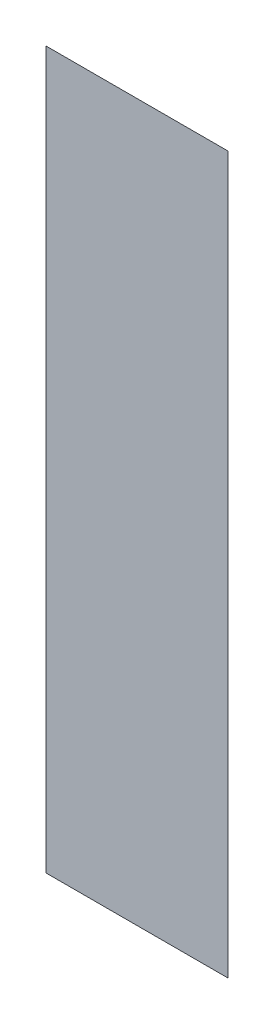
ISO-10303-21;
HEADER;
FILE_DESCRIPTION(('STEP AP214'),'2;1');
FILE_NAME('part.step','',(''),(''),'','','');
FILE_SCHEMA(('AUTOMOTIVE_DESIGN { 1 0 10303 214 1 1 1 1 }'));
ENDSEC;
DATA;
#1=APPLICATION_CONTEXT('core data for automotive mechanical design processes');
#2=APPLICATION_PROTOCOL_DEFINITION('international standard','automotive_design',2000,#1);
#3=PRODUCT_CONTEXT('',#1,'mechanical');
#4=PRODUCT('Part','Part','',(#3));
#5=PRODUCT_RELATED_PRODUCT_CATEGORY('part','',(#4));
#6=PRODUCT_DEFINITION_FORMATION('','',#4);
#7=PRODUCT_DEFINITION_CONTEXT('part definition',#1,'design');
#8=PRODUCT_DEFINITION('design','',#6,#7);
#9=PRODUCT_DEFINITION_SHAPE('','',#8);
#10=(LENGTH_UNIT() NAMED_UNIT(*) SI_UNIT(.MILLI.,.METRE.));
#11=(NAMED_UNIT(*) PLANE_ANGLE_UNIT() SI_UNIT($,.RADIAN.));
#12=(NAMED_UNIT(*) SI_UNIT($,.STERADIAN.) SOLID_ANGLE_UNIT());
#13=UNCERTAINTY_MEASURE_WITH_UNIT(LENGTH_MEASURE(1.E-05),#10,'distance_accuracy_value','');
#14=(GEOMETRIC_REPRESENTATION_CONTEXT(3) GLOBAL_UNCERTAINTY_ASSIGNED_CONTEXT((#13)) GLOBAL_UNIT_ASSIGNED_CONTEXT((#10,
#11,#12)) REPRESENTATION_CONTEXT('',''));
#15=CARTESIAN_POINT('',(0.,0.,0.));
#16=DIRECTION('',(0.,0.,1.));
#17=DIRECTION('',(1.,0.,0.));
#18=AXIS2_PLACEMENT_3D('',#15,#16,#17);
#19=CARTESIAN_POINT('',(-0.165974376974,0.773280378382,0.00045));
#20=DIRECTION('',(0.,0.,1.));
#21=DIRECTION('',(1.,0.,0.));
#22=AXIS2_PLACEMENT_3D('',#19,#20,#21);
#23=PLANE('',#22);
#24=CARTESIAN_POINT('',(-0.175976284199,0.773280378382,0.00045));
#25=DIRECTION('',(1.,0.,0.));
#26=VECTOR('',#25,1.);
#27=LINE('',#24,#26);
#28=CARTESIAN_POINT('',(-0.175976284199,0.773280378382,0.000225));
#29=VERTEX_POINT('',#28);
#30=CARTESIAN_POINT('',(-0.155972469749,0.773280378382,0.000225));
#31=VERTEX_POINT('',#30);
#32=EDGE_CURVE('E41',#29,#31,#27,.T.);
#33=ORIENTED_EDGE('',*,*,#32,.T.);
#34=CARTESIAN_POINT('',(-0.155972469749,0.773280378382,0.00045));
#35=DIRECTION('',(0.,1.,0.));
#36=VECTOR('',#35,1.);
#37=LINE('',#34,#36);
#38=CARTESIAN_POINT('',(-0.155972469749,0.852070542747,0.000225));
#39=VERTEX_POINT('',#38);
#40=EDGE_CURVE('E28',#31,#39,#37,.T.);
#41=ORIENTED_EDGE('',*,*,#40,.T.);
#42=CARTESIAN_POINT('',(-0.155972469749,0.852070542747,0.00045));
#43=DIRECTION('',(-1.,0.,0.));
#44=VECTOR('',#43,1.);
#45=LINE('',#42,#44);
#46=CARTESIAN_POINT('',(-0.175976284199,0.852070542747,0.000225));
#47=VERTEX_POINT('',#46);
#48=EDGE_CURVE('E11',#39,#47,#45,.T.);
#49=ORIENTED_EDGE('',*,*,#48,.T.);
#50=CARTESIAN_POINT('',(-0.175976284199,0.852070542747,0.00045));
#51=DIRECTION('',(0.,-1.,0.));
#52=VECTOR('',#51,1.);
#53=LINE('',#50,#52);
#54=EDGE_CURVE('E44',#47,#29,#53,.T.);
#55=ORIENTED_EDGE('',*,*,#54,.T.);
#56=EDGE_LOOP('',(#33,#41,#49,#55));
#57=FACE_BOUND('',#56,.T.);
#58=ADVANCED_FACE('F17',(#57),#23,.T.);
#59=CARTESIAN_POINT('',(-0.165974376974,0.773280378382,0.));
#60=DIRECTION('',(0.,0.,1.));
#61=DIRECTION('',(1.,0.,0.));
#62=AXIS2_PLACEMENT_3D('',#59,#60,#61);
#63=PLANE('',#62);
#64=ORIENTED_EDGE('',*,*,#40,.F.);
#65=ORIENTED_EDGE('',*,*,#32,.F.);
#66=ORIENTED_EDGE('',*,*,#54,.F.);
#67=ORIENTED_EDGE('',*,*,#48,.F.);
#68=EDGE_LOOP('',(#64,#65,#66,#67));
#69=FACE_BOUND('',#68,.T.);
#70=ADVANCED_FACE('F46',(#69),#63,.F.);
#71=CLOSED_SHELL('',(#58,#70));
#72=MANIFOLD_SOLID_BREP('B1',#71);
#73=ADVANCED_BREP_SHAPE_REPRESENTATION('',(#18,#72),#14);
#74=SHAPE_DEFINITION_REPRESENTATION(#9,#73);
ENDSEC;
END-ISO-10303-21;
